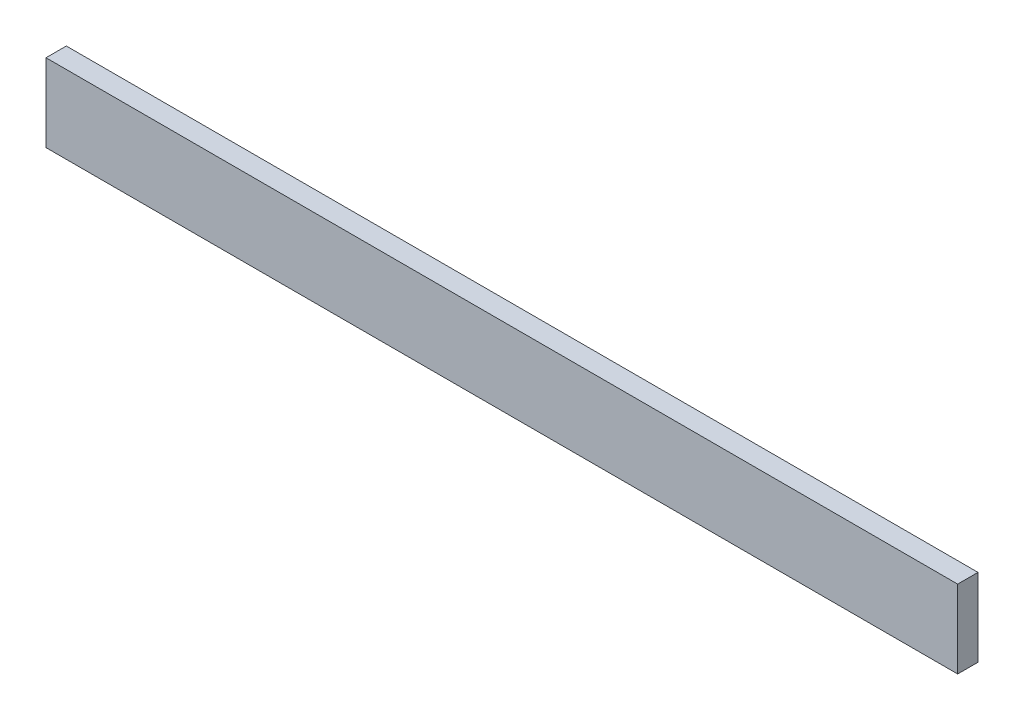
ISO-10303-21;
HEADER;
FILE_DESCRIPTION(('STEP AP214'),'2;1');
FILE_NAME('part.step','',(''),(''),'','','');
FILE_SCHEMA(('AUTOMOTIVE_DESIGN { 1 0 10303 214 1 1 1 1 }'));
ENDSEC;
DATA;
#1=APPLICATION_CONTEXT('core data for automotive mechanical design processes');
#2=APPLICATION_PROTOCOL_DEFINITION('international standard','automotive_design',2000,#1);
#3=PRODUCT_CONTEXT('',#1,'mechanical');
#4=PRODUCT('Part','Part','',(#3));
#5=PRODUCT_RELATED_PRODUCT_CATEGORY('part','',(#4));
#6=PRODUCT_DEFINITION_FORMATION('','',#4);
#7=PRODUCT_DEFINITION_CONTEXT('part definition',#1,'design');
#8=PRODUCT_DEFINITION('design','',#6,#7);
#9=PRODUCT_DEFINITION_SHAPE('','',#8);
#10=(LENGTH_UNIT() NAMED_UNIT(*) SI_UNIT(.MILLI.,.METRE.));
#11=(NAMED_UNIT(*) PLANE_ANGLE_UNIT() SI_UNIT($,.RADIAN.));
#12=(NAMED_UNIT(*) SI_UNIT($,.STERADIAN.) SOLID_ANGLE_UNIT());
#13=UNCERTAINTY_MEASURE_WITH_UNIT(LENGTH_MEASURE(1.E-05),#10,'distance_accuracy_value','');
#14=(GEOMETRIC_REPRESENTATION_CONTEXT(3) GLOBAL_UNCERTAINTY_ASSIGNED_CONTEXT((#13)) GLOBAL_UNIT_ASSIGNED_CONTEXT((#10,
#11,#12)) REPRESENTATION_CONTEXT('',''));
#15=CARTESIAN_POINT('',(0.,0.,0.));
#16=DIRECTION('',(0.,0.,1.));
#17=DIRECTION('',(1.,0.,0.));
#18=AXIS2_PLACEMENT_3D('',#15,#16,#17);
#19=CARTESIAN_POINT('',(0.,38.2926221353073,10.));
#20=DIRECTION('',(1.,0.,0.));
#21=DIRECTION('',(0.,0.,-1.));
#22=AXIS2_PLACEMENT_3D('',#19,#20,#21);
#23=PLANE('',#22);
#24=DIRECTION('',(0.,-1.,0.));
#25=VECTOR('',#24,1.);
#26=CARTESIAN_POINT('',(0.,38.2926221353073,0.));
#27=LINE('',#26,#25);
#28=CARTESIAN_POINT('',(0.,38.2926221353073,0.));
#29=VERTEX_POINT('',#28);
#30=CARTESIAN_POINT('',(0.,0.,0.));
#31=VERTEX_POINT('',#30);
#32=EDGE_CURVE('E113',#29,#31,#27,.T.);
#33=ORIENTED_EDGE('',*,*,#32,.T.);
#34=DIRECTION('',(0.,0.,-1.));
#35=VECTOR('',#34,1.);
#36=CARTESIAN_POINT('',(0.,0.,10.));
#37=LINE('',#36,#35);
#38=CARTESIAN_POINT('',(0.,0.,10.));
#39=VERTEX_POINT('',#38);
#40=EDGE_CURVE('E11',#39,#31,#37,.T.);
#41=ORIENTED_EDGE('',*,*,#40,.F.);
#42=DIRECTION('',(0.,-1.,0.));
#43=VECTOR('',#42,1.);
#44=CARTESIAN_POINT('',(0.,38.2926221353073,10.));
#45=LINE('',#44,#43);
#46=CARTESIAN_POINT('',(0.,38.2926221353073,10.));
#47=VERTEX_POINT('',#46);
#48=EDGE_CURVE('E97',#47,#39,#45,.T.);
#49=ORIENTED_EDGE('',*,*,#48,.F.);
#50=DIRECTION('',(0.,0.,-1.));
#51=VECTOR('',#50,1.);
#52=CARTESIAN_POINT('',(0.,38.2926221353073,10.));
#53=LINE('',#52,#51);
#54=EDGE_CURVE('E109',#47,#29,#53,.T.);
#55=ORIENTED_EDGE('',*,*,#54,.T.);
#56=EDGE_LOOP('',(#33,#41,#49,#55));
#57=FACE_BOUND('',#56,.T.);
#58=ADVANCED_FACE('F45',(#57),#23,.F.);
#59=CARTESIAN_POINT('',(0.,0.,10.));
#60=DIRECTION('',(0.,1.,0.));
#61=DIRECTION('',(0.,0.,1.));
#62=AXIS2_PLACEMENT_3D('',#59,#60,#61);
#63=PLANE('',#62);
#64=DIRECTION('',(1.,0.,0.));
#65=VECTOR('',#64,1.);
#66=CARTESIAN_POINT('',(0.,0.,0.));
#67=LINE('',#66,#65);
#68=CARTESIAN_POINT('',(448.417155537456,0.,0.));
#69=VERTEX_POINT('',#68);
#70=EDGE_CURVE('E102',#31,#69,#67,.T.);
#71=ORIENTED_EDGE('',*,*,#70,.T.);
#72=DIRECTION('',(0.,0.,-1.));
#73=VECTOR('',#72,1.);
#74=CARTESIAN_POINT('',(448.417155537456,0.,10.));
#75=LINE('',#74,#73);
#76=CARTESIAN_POINT('',(448.417155537456,0.,10.));
#77=VERTEX_POINT('',#76);
#78=EDGE_CURVE('E54',#77,#69,#75,.T.);
#79=ORIENTED_EDGE('',*,*,#78,.F.);
#80=DIRECTION('',(1.,0.,0.));
#81=VECTOR('',#80,1.);
#82=CARTESIAN_POINT('',(0.,0.,10.));
#83=LINE('',#82,#81);
#84=EDGE_CURVE('E92',#39,#77,#83,.T.);
#85=ORIENTED_EDGE('',*,*,#84,.F.);
#86=ORIENTED_EDGE('',*,*,#40,.T.);
#87=EDGE_LOOP('',(#71,#79,#85,#86));
#88=FACE_BOUND('',#87,.T.);
#89=ADVANCED_FACE('F101',(#88),#63,.F.);
#90=CARTESIAN_POINT('',(448.417155537456,0.,10.));
#91=DIRECTION('',(-1.,0.,0.));
#92=DIRECTION('',(0.,0.,1.));
#93=AXIS2_PLACEMENT_3D('',#90,#91,#92);
#94=PLANE('',#93);
#95=DIRECTION('',(0.,1.,0.));
#96=VECTOR('',#95,1.);
#97=CARTESIAN_POINT('',(448.417155537456,0.,0.));
#98=LINE('',#97,#96);
#99=CARTESIAN_POINT('',(448.417155537456,38.2926221353073,0.));
#100=VERTEX_POINT('',#99);
#101=EDGE_CURVE('E79',#69,#100,#98,.T.);
#102=ORIENTED_EDGE('',*,*,#101,.T.);
#103=DIRECTION('',(0.,0.,-1.));
#104=VECTOR('',#103,1.);
#105=CARTESIAN_POINT('',(448.417155537456,38.2926221353073,10.));
#106=LINE('',#105,#104);
#107=CARTESIAN_POINT('',(448.417155537456,38.2926221353073,10.));
#108=VERTEX_POINT('',#107);
#109=EDGE_CURVE('E104',#108,#100,#106,.T.);
#110=ORIENTED_EDGE('',*,*,#109,.F.);
#111=DIRECTION('',(0.,1.,0.));
#112=VECTOR('',#111,1.);
#113=CARTESIAN_POINT('',(448.417155537456,0.,10.));
#114=LINE('',#113,#112);
#115=EDGE_CURVE('E95',#77,#108,#114,.T.);
#116=ORIENTED_EDGE('',*,*,#115,.F.);
#117=ORIENTED_EDGE('',*,*,#78,.T.);
#118=EDGE_LOOP('',(#102,#110,#116,#117));
#119=FACE_BOUND('',#118,.T.);
#120=ADVANCED_FACE('F105',(#119),#94,.F.);
#121=CARTESIAN_POINT('',(448.417155537456,38.2926221353073,10.));
#122=DIRECTION('',(0.,-1.,0.));
#123=DIRECTION('',(0.,0.,-1.));
#124=AXIS2_PLACEMENT_3D('',#121,#122,#123);
#125=PLANE('',#124);
#126=DIRECTION('',(-1.,0.,0.));
#127=VECTOR('',#126,1.);
#128=CARTESIAN_POINT('',(448.417155537456,38.2926221353073,0.));
#129=LINE('',#128,#127);
#130=EDGE_CURVE('E85',#100,#29,#129,.T.);
#131=ORIENTED_EDGE('',*,*,#130,.T.);
#132=ORIENTED_EDGE('',*,*,#54,.F.);
#133=DIRECTION('',(-1.,0.,0.));
#134=VECTOR('',#133,1.);
#135=CARTESIAN_POINT('',(448.417155537456,38.2926221353073,10.));
#136=LINE('',#135,#134);
#137=EDGE_CURVE('E62',#108,#47,#136,.T.);
#138=ORIENTED_EDGE('',*,*,#137,.F.);
#139=ORIENTED_EDGE('',*,*,#109,.T.);
#140=EDGE_LOOP('',(#131,#132,#138,#139));
#141=FACE_BOUND('',#140,.T.);
#142=ADVANCED_FACE('F126',(#141),#125,.F.);
#143=CARTESIAN_POINT('',(0.,0.,10.));
#144=DIRECTION('',(0.,0.,1.));
#145=DIRECTION('',(1.,0.,0.));
#146=AXIS2_PLACEMENT_3D('',#143,#144,#145);
#147=PLANE('',#146);
#148=ORIENTED_EDGE('',*,*,#48,.T.);
#149=ORIENTED_EDGE('',*,*,#84,.T.);
#150=ORIENTED_EDGE('',*,*,#115,.T.);
#151=ORIENTED_EDGE('',*,*,#137,.T.);
#152=EDGE_LOOP('',(#148,#149,#150,#151));
#153=FACE_BOUND('',#152,.T.);
#154=ADVANCED_FACE('F93',(#153),#147,.T.);
#155=CARTESIAN_POINT('',(0.,0.,0.));
#156=DIRECTION('',(0.,0.,1.));
#157=DIRECTION('',(1.,0.,0.));
#158=AXIS2_PLACEMENT_3D('',#155,#156,#157);
#159=PLANE('',#158);
#160=ORIENTED_EDGE('',*,*,#32,.F.);
#161=ORIENTED_EDGE('',*,*,#130,.F.);
#162=ORIENTED_EDGE('',*,*,#101,.F.);
#163=ORIENTED_EDGE('',*,*,#70,.F.);
#164=EDGE_LOOP('',(#160,#161,#162,#163));
#165=FACE_BOUND('',#164,.T.);
#166=ADVANCED_FACE('F129',(#165),#159,.F.);
#167=CLOSED_SHELL('',(#58,#89,#120,#142,#154,#166));
#168=MANIFOLD_SOLID_BREP('B2',#167);
#169=ADVANCED_BREP_SHAPE_REPRESENTATION('',(#18,#168),#14);
#170=SHAPE_DEFINITION_REPRESENTATION(#9,#169);
ENDSEC;
END-ISO-10303-21;
